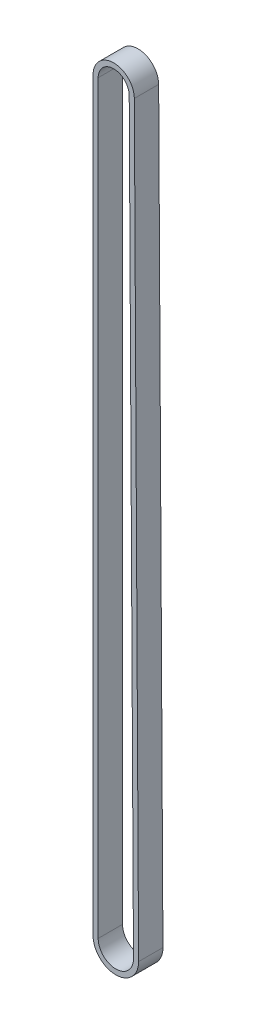
ISO-10303-21;
HEADER;
FILE_DESCRIPTION(('STEP AP214'),'2;1');
FILE_NAME('part.step','',(''),(''),'','','');
FILE_SCHEMA(('AUTOMOTIVE_DESIGN { 1 0 10303 214 1 1 1 1 }'));
ENDSEC;
DATA;
#1=APPLICATION_CONTEXT('core data for automotive mechanical design processes');
#2=APPLICATION_PROTOCOL_DEFINITION('international standard','automotive_design',2000,#1);
#3=PRODUCT_CONTEXT('',#1,'mechanical');
#4=PRODUCT('Part','Part','',(#3));
#5=PRODUCT_RELATED_PRODUCT_CATEGORY('part','',(#4));
#6=PRODUCT_DEFINITION_FORMATION('','',#4);
#7=PRODUCT_DEFINITION_CONTEXT('part definition',#1,'design');
#8=PRODUCT_DEFINITION('design','',#6,#7);
#9=PRODUCT_DEFINITION_SHAPE('','',#8);
#10=(LENGTH_UNIT() NAMED_UNIT(*) SI_UNIT(.MILLI.,.METRE.));
#11=(NAMED_UNIT(*) PLANE_ANGLE_UNIT() SI_UNIT($,.RADIAN.));
#12=(NAMED_UNIT(*) SI_UNIT($,.STERADIAN.) SOLID_ANGLE_UNIT());
#13=UNCERTAINTY_MEASURE_WITH_UNIT(LENGTH_MEASURE(1.E-05),#10,'distance_accuracy_value','');
#14=(GEOMETRIC_REPRESENTATION_CONTEXT(3) GLOBAL_UNCERTAINTY_ASSIGNED_CONTEXT((#13)) GLOBAL_UNIT_ASSIGNED_CONTEXT((#10,
#11,#12)) REPRESENTATION_CONTEXT('',''));
#15=CARTESIAN_POINT('',(0.,0.,0.));
#16=DIRECTION('',(0.,0.,1.));
#17=DIRECTION('',(1.,0.,0.));
#18=AXIS2_PLACEMENT_3D('',#15,#16,#17);
#19=CARTESIAN_POINT('',(330.556453180617,-302.445914231933,-6.2));
#20=DIRECTION('',(0.,0.,1.));
#21=DIRECTION('',(1.,0.,0.));
#22=AXIS2_PLACEMENT_3D('',#19,#20,#21);
#23=CYLINDRICAL_SURFACE('',#22,5.80000000000002);
#24=CARTESIAN_POINT('',(330.556453180617,-302.445914231933,0.));
#25=DIRECTION('',(0.,0.,1.));
#26=DIRECTION('',(-1.,0.,0.));
#27=AXIS2_PLACEMENT_3D('',#24,#25,#26);
#28=CIRCLE('',#27,5.80000000000002);
#29=CARTESIAN_POINT('',(324.75645318063,-302.44592645671,0.));
#30=VERTEX_POINT('',#29);
#31=CARTESIAN_POINT('',(336.356357561082,-302.412609915847,0.));
#32=VERTEX_POINT('',#31);
#33=EDGE_CURVE('E126',#30,#32,#28,.T.);
#34=ORIENTED_EDGE('',*,*,#33,.F.);
#35=DIRECTION('',(0.,0.,1.));
#36=VECTOR('',#35,1.);
#37=CARTESIAN_POINT('',(324.75645318063,-302.44592645671,-6.2));
#38=LINE('',#37,#36);
#39=CARTESIAN_POINT('',(324.75645318063,-302.44592645671,-6.2));
#40=VERTEX_POINT('',#39);
#41=EDGE_CURVE('E11',#40,#30,#38,.T.);
#42=ORIENTED_EDGE('',*,*,#41,.F.);
#43=CARTESIAN_POINT('',(330.556453180617,-302.445914231933,-6.2));
#44=DIRECTION('',(0.,0.,1.));
#45=DIRECTION('',(-1.,0.,0.));
#46=AXIS2_PLACEMENT_3D('',#43,#44,#45);
#47=CIRCLE('',#46,5.80000000000002);
#48=CARTESIAN_POINT('',(336.356357561082,-302.412609915847,-6.2));
#49=VERTEX_POINT('',#48);
#50=EDGE_CURVE('E129',#40,#49,#47,.T.);
#51=ORIENTED_EDGE('',*,*,#50,.T.);
#52=DIRECTION('',(0.,0.,1.));
#53=VECTOR('',#52,1.);
#54=CARTESIAN_POINT('',(336.356357561082,-302.412609915847,-6.2));
#55=LINE('',#54,#53);
#56=EDGE_CURVE('E142',#49,#32,#55,.T.);
#57=ORIENTED_EDGE('',*,*,#56,.T.);
#58=EDGE_LOOP('',(#34,#42,#51,#57));
#59=FACE_BOUND('',#58,.T.);
#60=ADVANCED_FACE('F32',(#59),#23,.T.);
#61=CARTESIAN_POINT('',(324.75645318063,-302.44592645671,-6.2));
#62=DIRECTION('',(-0.999999999997779,-2.10772007740839E-06,0.));
#63=DIRECTION('',(2.10772007740839E-06,-0.999999999997779,0.));
#64=AXIS2_PLACEMENT_3D('',#61,#62,#63);
#65=PLANE('',#64);
#66=DIRECTION('',(2.10772007740839E-06,-0.999999999997779,0.));
#67=VECTOR('',#66,1.);
#68=CARTESIAN_POINT('',(324.75645318063,-302.44592645671,0.));
#69=LINE('',#68,#67);
#70=CARTESIAN_POINT('',(324.75605293871,-112.552626658617,0.));
#71=VERTEX_POINT('',#70);
#72=EDGE_CURVE('E133',#71,#30,#69,.T.);
#73=ORIENTED_EDGE('',*,*,#72,.F.);
#74=DIRECTION('',(0.,0.,1.));
#75=VECTOR('',#74,1.);
#76=CARTESIAN_POINT('',(324.75605293871,-112.552626658617,-6.2));
#77=LINE('',#76,#75);
#78=CARTESIAN_POINT('',(324.75605293871,-112.552626658617,-6.2));
#79=VERTEX_POINT('',#78);
#80=EDGE_CURVE('E40',#79,#71,#77,.T.);
#81=ORIENTED_EDGE('',*,*,#80,.F.);
#82=DIRECTION('',(2.10772007740839E-06,-0.999999999997779,0.));
#83=VECTOR('',#82,1.);
#84=CARTESIAN_POINT('',(324.75645318063,-302.44592645671,-6.2));
#85=LINE('',#84,#83);
#86=EDGE_CURVE('E139',#79,#40,#85,.T.);
#87=ORIENTED_EDGE('',*,*,#86,.T.);
#88=ORIENTED_EDGE('',*,*,#41,.T.);
#89=EDGE_LOOP('',(#73,#81,#87,#88));
#90=FACE_BOUND('',#89,.T.);
#91=ADVANCED_FACE('F185',(#90),#65,.T.);
#92=CARTESIAN_POINT('',(330.011053181053,-112.552615582548,-6.2));
#93=DIRECTION('',(0.,0.,1.));
#94=DIRECTION('',(1.,0.,0.));
#95=AXIS2_PLACEMENT_3D('',#92,#93,#94);
#96=CYLINDRICAL_SURFACE('',#95,5.25500024235529);
#97=CARTESIAN_POINT('',(330.011053181053,-112.552615582548,0.));
#98=DIRECTION('',(0.,0.,1.));
#99=DIRECTION('',(1.,0.,0.));
#100=AXIS2_PLACEMENT_3D('',#97,#98,#99);
#101=CIRCLE('',#100,5.25500024235529);
#102=CARTESIAN_POINT('',(335.265966788808,-112.522440722357,0.));
#103=VERTEX_POINT('',#102);
#104=EDGE_CURVE('E148',#103,#71,#101,.T.);
#105=ORIENTED_EDGE('',*,*,#104,.F.);
#106=DIRECTION('',(0.,0.,1.));
#107=VECTOR('',#106,1.);
#108=CARTESIAN_POINT('',(335.265966788808,-112.522440722357,-6.2));
#109=LINE('',#108,#107);
#110=CARTESIAN_POINT('',(335.265966788808,-112.522440722357,-6.2));
#111=VERTEX_POINT('',#110);
#112=EDGE_CURVE('E154',#111,#103,#109,.T.);
#113=ORIENTED_EDGE('',*,*,#112,.F.);
#114=CARTESIAN_POINT('',(330.011053181053,-112.552615582548,-6.2));
#115=DIRECTION('',(0.,0.,1.));
#116=DIRECTION('',(1.,0.,0.));
#117=AXIS2_PLACEMENT_3D('',#114,#115,#116);
#118=CIRCLE('',#117,5.25500024235529);
#119=EDGE_CURVE('E136',#111,#79,#118,.T.);
#120=ORIENTED_EDGE('',*,*,#119,.T.);
#121=ORIENTED_EDGE('',*,*,#80,.T.);
#122=EDGE_LOOP('',(#105,#113,#120,#121));
#123=FACE_BOUND('',#122,.T.);
#124=ADVANCED_FACE('F190',(#123),#96,.T.);
#125=CARTESIAN_POINT('',(336.356357561082,-302.412609915847,-6.2));
#126=DIRECTION('',(0.999983513873171,0.00574212346317981,0.));
#127=DIRECTION('',(-0.00574212346317981,0.999983513873171,0.));
#128=AXIS2_PLACEMENT_3D('',#125,#126,#127);
#129=PLANE('',#128);
#130=DIRECTION('',(-0.00574212346317981,0.999983513873171,0.));
#131=VECTOR('',#130,1.);
#132=CARTESIAN_POINT('',(336.356357561082,-302.412609915847,0.));
#133=LINE('',#132,#131);
#134=EDGE_CURVE('E145',#32,#103,#133,.T.);
#135=ORIENTED_EDGE('',*,*,#134,.F.);
#136=ORIENTED_EDGE('',*,*,#56,.F.);
#137=DIRECTION('',(-0.00574212346317981,0.999983513873171,0.));
#138=VECTOR('',#137,1.);
#139=CARTESIAN_POINT('',(336.356357561082,-302.412609915847,-6.2));
#140=LINE('',#139,#138);
#141=EDGE_CURVE('E132',#49,#111,#140,.T.);
#142=ORIENTED_EDGE('',*,*,#141,.T.);
#143=ORIENTED_EDGE('',*,*,#112,.T.);
#144=EDGE_LOOP('',(#135,#136,#142,#143));
#145=FACE_BOUND('',#144,.T.);
#146=ADVANCED_FACE('F202',(#145),#129,.T.);
#147=CARTESIAN_POINT('',(330.556453180617,-302.445914231933,-6.2));
#148=DIRECTION('',(0.,0.,-1.));
#149=DIRECTION('',(-1.,0.,0.));
#150=AXIS2_PLACEMENT_3D('',#147,#148,#149);
#151=PLANE('',#150);
#152=CARTESIAN_POINT('',(330.556453180617,-302.445914231933,-6.2));
#153=DIRECTION('',(0.,0.,1.));
#154=DIRECTION('',(-1.,0.,0.));
#155=AXIS2_PLACEMENT_3D('',#152,#153,#154);
#156=CIRCLE('',#155,4.50000000000002);
#157=CARTESIAN_POINT('',(326.056453180627,-302.445923716674,-6.2));
#158=VERTEX_POINT('',#157);
#159=CARTESIAN_POINT('',(335.056378993047,-302.420074676349,-6.2));
#160=VERTEX_POINT('',#159);
#161=EDGE_CURVE('E99',#158,#160,#156,.T.);
#162=ORIENTED_EDGE('',*,*,#161,.T.);
#163=DIRECTION('',(-0.00574212346318011,0.999983513873171,0.));
#164=VECTOR('',#163,1.);
#165=CARTESIAN_POINT('',(335.056378993047,-302.420074676349,-6.2));
#166=LINE('',#165,#164);
#167=CARTESIAN_POINT('',(333.965988220773,-112.529905482859,-6.2));
#168=VERTEX_POINT('',#167);
#169=EDGE_CURVE('E108',#160,#168,#166,.T.);
#170=ORIENTED_EDGE('',*,*,#169,.T.);
#171=CARTESIAN_POINT('',(330.011053181053,-112.552615582548,-6.2));
#172=DIRECTION('',(0.,0.,1.));
#173=DIRECTION('',(1.,0.,0.));
#174=AXIS2_PLACEMENT_3D('',#171,#172,#173);
#175=CIRCLE('',#174,3.9550002423552);
#176=CARTESIAN_POINT('',(326.056052938707,-112.552623918581,-6.2));
#177=VERTEX_POINT('',#176);
#178=EDGE_CURVE('E48',#168,#177,#175,.T.);
#179=ORIENTED_EDGE('',*,*,#178,.T.);
#180=DIRECTION('',(2.10772007682374E-06,-0.999999999997779,0.));
#181=VECTOR('',#180,1.);
#182=CARTESIAN_POINT('',(326.056453180627,-302.445923716674,-6.2));
#183=LINE('',#182,#181);
#184=EDGE_CURVE('E105',#177,#158,#183,.T.);
#185=ORIENTED_EDGE('',*,*,#184,.T.);
#186=EDGE_LOOP('',(#162,#170,#179,#185));
#187=FACE_BOUND('',#186,.T.);
#188=ORIENTED_EDGE('',*,*,#50,.F.);
#189=ORIENTED_EDGE('',*,*,#86,.F.);
#190=ORIENTED_EDGE('',*,*,#119,.F.);
#191=ORIENTED_EDGE('',*,*,#141,.F.);
#192=EDGE_LOOP('',(#188,#189,#190,#191));
#193=FACE_BOUND('',#192,.T.);
#194=ADVANCED_FACE('F112',(#187,#193),#151,.T.);
#195=CARTESIAN_POINT('',(330.556453180617,-302.445914231933,0.));
#196=DIRECTION('',(0.,0.,-1.));
#197=DIRECTION('',(-1.,0.,0.));
#198=AXIS2_PLACEMENT_3D('',#195,#196,#197);
#199=PLANE('',#198);
#200=DIRECTION('',(-0.00574212346318011,0.999983513873171,0.));
#201=VECTOR('',#200,1.);
#202=CARTESIAN_POINT('',(335.056378993047,-302.420074676349,0.));
#203=LINE('',#202,#201);
#204=CARTESIAN_POINT('',(335.056378993047,-302.420074676349,0.));
#205=VERTEX_POINT('',#204);
#206=CARTESIAN_POINT('',(333.965988220773,-112.529905482859,0.));
#207=VERTEX_POINT('',#206);
#208=EDGE_CURVE('E122',#205,#207,#203,.T.);
#209=ORIENTED_EDGE('',*,*,#208,.F.);
#210=CARTESIAN_POINT('',(330.556453180617,-302.445914231933,0.));
#211=DIRECTION('',(0.,0.,1.));
#212=DIRECTION('',(-1.,0.,0.));
#213=AXIS2_PLACEMENT_3D('',#210,#211,#212);
#214=CIRCLE('',#213,4.50000000000002);
#215=CARTESIAN_POINT('',(326.056453180627,-302.445923716674,0.));
#216=VERTEX_POINT('',#215);
#217=EDGE_CURVE('E56',#216,#205,#214,.T.);
#218=ORIENTED_EDGE('',*,*,#217,.F.);
#219=DIRECTION('',(2.10772007682374E-06,-0.999999999997779,0.));
#220=VECTOR('',#219,1.);
#221=CARTESIAN_POINT('',(326.056453180627,-302.445923716674,0.));
#222=LINE('',#221,#220);
#223=CARTESIAN_POINT('',(326.056052938707,-112.552623918581,0.));
#224=VERTEX_POINT('',#223);
#225=EDGE_CURVE('E115',#224,#216,#222,.T.);
#226=ORIENTED_EDGE('',*,*,#225,.F.);
#227=CARTESIAN_POINT('',(330.011053181053,-112.552615582548,0.));
#228=DIRECTION('',(0.,0.,1.));
#229=DIRECTION('',(1.,0.,0.));
#230=AXIS2_PLACEMENT_3D('',#227,#228,#229);
#231=CIRCLE('',#230,3.9550002423552);
#232=EDGE_CURVE('E118',#207,#224,#231,.T.);
#233=ORIENTED_EDGE('',*,*,#232,.F.);
#234=EDGE_LOOP('',(#209,#218,#226,#233));
#235=FACE_BOUND('',#234,.T.);
#236=ORIENTED_EDGE('',*,*,#33,.T.);
#237=ORIENTED_EDGE('',*,*,#134,.T.);
#238=ORIENTED_EDGE('',*,*,#104,.T.);
#239=ORIENTED_EDGE('',*,*,#72,.T.);
#240=EDGE_LOOP('',(#236,#237,#238,#239));
#241=FACE_BOUND('',#240,.T.);
#242=ADVANCED_FACE('F172',(#235,#241),#199,.F.);
#243=CARTESIAN_POINT('',(330.556453180617,-302.445914231933,-6.2));
#244=DIRECTION('',(0.,0.,1.));
#245=DIRECTION('',(1.,0.,0.));
#246=AXIS2_PLACEMENT_3D('',#243,#244,#245);
#247=CYLINDRICAL_SURFACE('',#246,4.50000000000002);
#248=ORIENTED_EDGE('',*,*,#217,.T.);
#249=DIRECTION('',(0.,0.,1.));
#250=VECTOR('',#249,1.);
#251=CARTESIAN_POINT('',(335.056378993047,-302.420074676349,-6.2));
#252=LINE('',#251,#250);
#253=EDGE_CURVE('E95',#160,#205,#252,.T.);
#254=ORIENTED_EDGE('',*,*,#253,.F.);
#255=ORIENTED_EDGE('',*,*,#161,.F.);
#256=DIRECTION('',(0.,0.,1.));
#257=VECTOR('',#256,1.);
#258=CARTESIAN_POINT('',(326.056453180627,-302.445923716674,-6.2));
#259=LINE('',#258,#257);
#260=EDGE_CURVE('E124',#158,#216,#259,.T.);
#261=ORIENTED_EDGE('',*,*,#260,.T.);
#262=EDGE_LOOP('',(#248,#254,#255,#261));
#263=FACE_BOUND('',#262,.T.);
#264=ADVANCED_FACE('F97',(#263),#247,.F.);
#265=CARTESIAN_POINT('',(326.056453180627,-302.445923716674,-6.2));
#266=DIRECTION('',(-0.999999999997779,-2.10772007682374E-06,0.));
#267=DIRECTION('',(2.10772007682374E-06,-0.999999999997779,0.));
#268=AXIS2_PLACEMENT_3D('',#265,#266,#267);
#269=PLANE('',#268);
#270=ORIENTED_EDGE('',*,*,#225,.T.);
#271=ORIENTED_EDGE('',*,*,#260,.F.);
#272=ORIENTED_EDGE('',*,*,#184,.F.);
#273=DIRECTION('',(0.,0.,1.));
#274=VECTOR('',#273,1.);
#275=CARTESIAN_POINT('',(326.056052938707,-112.552623918581,-6.2));
#276=LINE('',#275,#274);
#277=EDGE_CURVE('E127',#177,#224,#276,.T.);
#278=ORIENTED_EDGE('',*,*,#277,.T.);
#279=EDGE_LOOP('',(#270,#271,#272,#278));
#280=FACE_BOUND('',#279,.T.);
#281=ADVANCED_FACE('F175',(#280),#269,.F.);
#282=CARTESIAN_POINT('',(330.011053181053,-112.552615582548,-6.2));
#283=DIRECTION('',(0.,0.,1.));
#284=DIRECTION('',(1.,0.,0.));
#285=AXIS2_PLACEMENT_3D('',#282,#283,#284);
#286=CYLINDRICAL_SURFACE('',#285,3.9550002423552);
#287=ORIENTED_EDGE('',*,*,#232,.T.);
#288=ORIENTED_EDGE('',*,*,#277,.F.);
#289=ORIENTED_EDGE('',*,*,#178,.F.);
#290=DIRECTION('',(0.,0.,1.));
#291=VECTOR('',#290,1.);
#292=CARTESIAN_POINT('',(333.965988220773,-112.529905482859,-6.2));
#293=LINE('',#292,#291);
#294=EDGE_CURVE('E104',#168,#207,#293,.T.);
#295=ORIENTED_EDGE('',*,*,#294,.T.);
#296=EDGE_LOOP('',(#287,#288,#289,#295));
#297=FACE_BOUND('',#296,.T.);
#298=ADVANCED_FACE('F170',(#297),#286,.F.);
#299=CARTESIAN_POINT('',(335.056378993047,-302.420074676349,-6.2));
#300=DIRECTION('',(0.999983513873171,0.00574212346318011,0.));
#301=DIRECTION('',(-0.00574212346318011,0.999983513873171,0.));
#302=AXIS2_PLACEMENT_3D('',#299,#300,#301);
#303=PLANE('',#302);
#304=ORIENTED_EDGE('',*,*,#208,.T.);
#305=ORIENTED_EDGE('',*,*,#294,.F.);
#306=ORIENTED_EDGE('',*,*,#169,.F.);
#307=ORIENTED_EDGE('',*,*,#253,.T.);
#308=EDGE_LOOP('',(#304,#305,#306,#307));
#309=FACE_BOUND('',#308,.T.);
#310=ADVANCED_FACE('F109',(#309),#303,.F.);
#311=CLOSED_SHELL('',(#60,#91,#124,#146,#194,#242,#264,#281,#298,#310));
#312=MANIFOLD_SOLID_BREP('B2',#311);
#313=ADVANCED_BREP_SHAPE_REPRESENTATION('',(#18,#312),#14);
#314=SHAPE_DEFINITION_REPRESENTATION(#9,#313);
ENDSEC;
END-ISO-10303-21;
